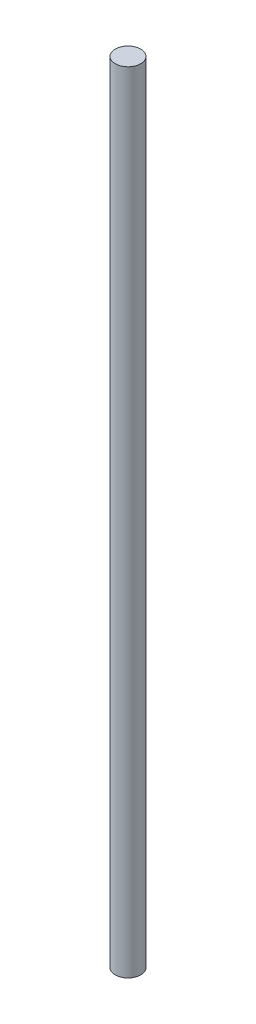
ISO-10303-21;
HEADER;
FILE_DESCRIPTION(('STEP AP214'),'2;1');
FILE_NAME('part.step','',(''),(''),'','','');
FILE_SCHEMA(('AUTOMOTIVE_DESIGN { 1 0 10303 214 1 1 1 1 }'));
ENDSEC;
DATA;
#1=APPLICATION_CONTEXT('core data for automotive mechanical design processes');
#2=APPLICATION_PROTOCOL_DEFINITION('international standard','automotive_design',2000,#1);
#3=PRODUCT_CONTEXT('',#1,'mechanical');
#4=PRODUCT('Part','Part','',(#3));
#5=PRODUCT_RELATED_PRODUCT_CATEGORY('part','',(#4));
#6=PRODUCT_DEFINITION_FORMATION('','',#4);
#7=PRODUCT_DEFINITION_CONTEXT('part definition',#1,'design');
#8=PRODUCT_DEFINITION('design','',#6,#7);
#9=PRODUCT_DEFINITION_SHAPE('','',#8);
#10=(LENGTH_UNIT() NAMED_UNIT(*) SI_UNIT(.MILLI.,.METRE.));
#11=(NAMED_UNIT(*) PLANE_ANGLE_UNIT() SI_UNIT($,.RADIAN.));
#12=(NAMED_UNIT(*) SI_UNIT($,.STERADIAN.) SOLID_ANGLE_UNIT());
#13=UNCERTAINTY_MEASURE_WITH_UNIT(LENGTH_MEASURE(1.E-05),#10,'distance_accuracy_value','');
#14=(GEOMETRIC_REPRESENTATION_CONTEXT(3) GLOBAL_UNCERTAINTY_ASSIGNED_CONTEXT((#13)) GLOBAL_UNIT_ASSIGNED_CONTEXT((#10,
#11,#12)) REPRESENTATION_CONTEXT('',''));
#15=CARTESIAN_POINT('',(0.,0.,0.));
#16=DIRECTION('',(0.,0.,1.));
#17=DIRECTION('',(1.,0.,0.));
#18=AXIS2_PLACEMENT_3D('',#15,#16,#17);
#19=CARTESIAN_POINT('',(0.,196.85,0.));
#20=DIRECTION('',(0.,-1.,0.));
#21=DIRECTION('',(0.,0.,-1.));
#22=AXIS2_PLACEMENT_3D('',#19,#20,#21);
#23=CYLINDRICAL_SURFACE('',#22,3.175);
#24=CARTESIAN_POINT('',(0.,196.85,0.));
#25=DIRECTION('',(0.,1.,0.));
#26=DIRECTION('',(0.,0.,1.));
#27=AXIS2_PLACEMENT_3D('',#24,#25,#26);
#28=CIRCLE('',#27,3.175);
#29=CARTESIAN_POINT('',(0.,196.85,3.175));
#30=VERTEX_POINT('',#29);
#31=EDGE_CURVE('E10',#30,#30,#28,.T.);
#32=ORIENTED_EDGE('',*,*,#31,.F.);
#33=EDGE_LOOP('',(#32));
#34=FACE_BOUND('',#33,.T.);
#35=CARTESIAN_POINT('',(0.,0.,0.));
#36=DIRECTION('',(0.,1.,0.));
#37=DIRECTION('',(0.,0.,1.));
#38=AXIS2_PLACEMENT_3D('',#35,#36,#37);
#39=CIRCLE('',#38,3.175);
#40=CARTESIAN_POINT('',(0.,0.,3.175));
#41=VERTEX_POINT('',#40);
#42=EDGE_CURVE('E49',#41,#41,#39,.T.);
#43=ORIENTED_EDGE('',*,*,#42,.T.);
#44=EDGE_LOOP('',(#43));
#45=FACE_BOUND('',#44,.T.);
#46=ADVANCED_FACE('F46',(#34,#45),#23,.T.);
#47=CARTESIAN_POINT('',(0.,196.85,0.));
#48=DIRECTION('',(0.,1.,0.));
#49=DIRECTION('',(0.,0.,1.));
#50=AXIS2_PLACEMENT_3D('',#47,#48,#49);
#51=PLANE('',#50);
#52=ORIENTED_EDGE('',*,*,#31,.T.);
#53=EDGE_LOOP('',(#52));
#54=FACE_BOUND('',#53,.T.);
#55=ADVANCED_FACE('F65',(#54),#51,.T.);
#56=CARTESIAN_POINT('',(0.,0.,0.));
#57=DIRECTION('',(0.,1.,0.));
#58=DIRECTION('',(0.,0.,1.));
#59=AXIS2_PLACEMENT_3D('',#56,#57,#58);
#60=PLANE('',#59);
#61=ORIENTED_EDGE('',*,*,#42,.F.);
#62=EDGE_LOOP('',(#61));
#63=FACE_BOUND('',#62,.T.);
#64=ADVANCED_FACE('F63',(#63),#60,.F.);
#65=CLOSED_SHELL('',(#46,#55,#64));
#66=MANIFOLD_SOLID_BREP('B2',#65);
#67=ADVANCED_BREP_SHAPE_REPRESENTATION('',(#18,#66),#14);
#68=SHAPE_DEFINITION_REPRESENTATION(#9,#67);
ENDSEC;
END-ISO-10303-21;
